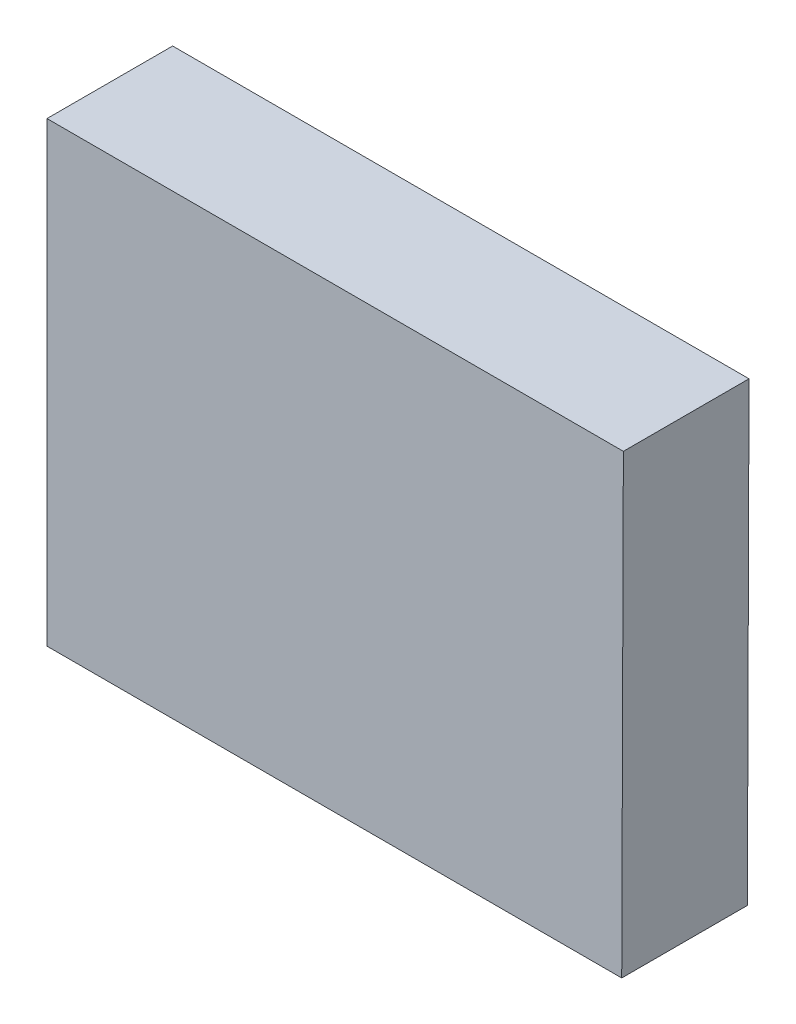
ISO-10303-21;
HEADER;
FILE_DESCRIPTION(('STEP AP214'),'2;1');
FILE_NAME('part.step','',(''),(''),'','','');
FILE_SCHEMA(('AUTOMOTIVE_DESIGN { 1 0 10303 214 1 1 1 1 }'));
ENDSEC;
DATA;
#1=APPLICATION_CONTEXT('core data for automotive mechanical design processes');
#2=APPLICATION_PROTOCOL_DEFINITION('international standard','automotive_design',2000,#1);
#3=PRODUCT_CONTEXT('',#1,'mechanical');
#4=PRODUCT('Part','Part','',(#3));
#5=PRODUCT_RELATED_PRODUCT_CATEGORY('part','',(#4));
#6=PRODUCT_DEFINITION_FORMATION('','',#4);
#7=PRODUCT_DEFINITION_CONTEXT('part definition',#1,'design');
#8=PRODUCT_DEFINITION('design','',#6,#7);
#9=PRODUCT_DEFINITION_SHAPE('','',#8);
#10=(LENGTH_UNIT() NAMED_UNIT(*) SI_UNIT(.MILLI.,.METRE.));
#11=(NAMED_UNIT(*) PLANE_ANGLE_UNIT() SI_UNIT($,.RADIAN.));
#12=(NAMED_UNIT(*) SI_UNIT($,.STERADIAN.) SOLID_ANGLE_UNIT());
#13=UNCERTAINTY_MEASURE_WITH_UNIT(LENGTH_MEASURE(1.E-05),#10,'distance_accuracy_value','');
#14=(GEOMETRIC_REPRESENTATION_CONTEXT(3) GLOBAL_UNCERTAINTY_ASSIGNED_CONTEXT((#13)) GLOBAL_UNIT_ASSIGNED_CONTEXT((#10,
#11,#12)) REPRESENTATION_CONTEXT('',''));
#15=CARTESIAN_POINT('',(0.,0.,0.));
#16=DIRECTION('',(0.,0.,1.));
#17=DIRECTION('',(1.,0.,0.));
#18=AXIS2_PLACEMENT_3D('',#15,#16,#17);
#19=CARTESIAN_POINT('',(2.50844558,-1.99999854,1.10000034));
#20=DIRECTION('',(0.,0.,1.));
#21=DIRECTION('',(1.,0.,0.));
#22=AXIS2_PLACEMENT_3D('',#19,#20,#21);
#23=PLANE('',#22);
#24=DIRECTION('',(0.,1.,0.));
#25=VECTOR('',#24,1.);
#26=CARTESIAN_POINT('',(-2.52276864,-1.99999346,1.10000034));
#27=LINE('',#26,#25);
#28=CARTESIAN_POINT('',(-2.52276864,-1.99999346000001,1.10000034));
#29=VERTEX_POINT('',#28);
#30=CARTESIAN_POINT('',(-2.52276864,2.00000108,1.10000034));
#31=VERTEX_POINT('',#30);
#32=EDGE_CURVE('E58',#29,#31,#27,.T.);
#33=ORIENTED_EDGE('',*,*,#32,.F.);
#34=DIRECTION('',(0.99999999999949,-1.0096966203115E-06,0.));
#35=VECTOR('',#34,1.);
#36=CARTESIAN_POINT('',(2.50844558,-1.99999854,1.10000034));
#37=LINE('',#36,#35);
#38=CARTESIAN_POINT('',(2.50844557999999,-1.99999854,1.10000034));
#39=VERTEX_POINT('',#38);
#40=EDGE_CURVE('E71',#39,#29,#37,.F.);
#41=ORIENTED_EDGE('',*,*,#40,.F.);
#42=DIRECTION('',(0.00358074238432357,0.999993589121439,0.));
#43=VECTOR('',#42,1.);
#44=CARTESIAN_POINT('',(2.52276864,2.00000108,1.10000034));
#45=LINE('',#44,#43);
#46=CARTESIAN_POINT('',(2.52276864,2.00000108,1.10000034));
#47=VERTEX_POINT('',#46);
#48=EDGE_CURVE('E20',#47,#39,#45,.F.);
#49=ORIENTED_EDGE('',*,*,#48,.F.);
#50=DIRECTION('',(1.,0.,0.));
#51=VECTOR('',#50,1.);
#52=CARTESIAN_POINT('',(-2.52276864,2.00000108,1.10000034));
#53=LINE('',#52,#51);
#54=EDGE_CURVE('E53',#31,#47,#53,.T.);
#55=ORIENTED_EDGE('',*,*,#54,.F.);
#56=EDGE_LOOP('',(#33,#41,#49,#55));
#57=FACE_BOUND('',#56,.T.);
#58=ADVANCED_FACE('F17',(#57),#23,.T.);
#59=CARTESIAN_POINT('',(2.52276864,2.00000108,0.));
#60=DIRECTION('',(0.999993589121439,-0.00358074238432357,0.));
#61=DIRECTION('',(0.00358074238432357,0.999993589121439,0.));
#62=AXIS2_PLACEMENT_3D('',#59,#60,#61);
#63=PLANE('',#62);
#64=DIRECTION('',(0.,0.,1.));
#65=VECTOR('',#64,1.);
#66=CARTESIAN_POINT('',(2.50844558,-1.99999854,0.));
#67=LINE('',#66,#65);
#68=CARTESIAN_POINT('',(2.50844557999999,-1.99999854,0.));
#69=VERTEX_POINT('',#68);
#70=EDGE_CURVE('E66',#69,#39,#67,.T.);
#71=ORIENTED_EDGE('',*,*,#70,.F.);
#72=DIRECTION('',(0.00358074238432357,0.999993589121439,0.));
#73=VECTOR('',#72,1.);
#74=CARTESIAN_POINT('',(2.52276864,2.00000108,0.));
#75=LINE('',#74,#73);
#76=CARTESIAN_POINT('',(2.52276864,2.00000108,0.));
#77=VERTEX_POINT('',#76);
#78=EDGE_CURVE('E74',#69,#77,#75,.T.);
#79=ORIENTED_EDGE('',*,*,#78,.T.);
#80=DIRECTION('',(0.,0.,1.));
#81=VECTOR('',#80,1.);
#82=CARTESIAN_POINT('',(2.52276864,2.00000108,0.));
#83=LINE('',#82,#81);
#84=EDGE_CURVE('E67',#47,#77,#83,.F.);
#85=ORIENTED_EDGE('',*,*,#84,.F.);
#86=ORIENTED_EDGE('',*,*,#48,.T.);
#87=EDGE_LOOP('',(#71,#79,#85,#86));
#88=FACE_BOUND('',#87,.T.);
#89=ADVANCED_FACE('F64',(#88),#63,.T.);
#90=CARTESIAN_POINT('',(-2.52276864,2.00000108,0.));
#91=DIRECTION('',(0.,1.,0.));
#92=DIRECTION('',(0.,0.,1.));
#93=AXIS2_PLACEMENT_3D('',#90,#91,#92);
#94=PLANE('',#93);
#95=ORIENTED_EDGE('',*,*,#84,.T.);
#96=DIRECTION('',(1.,0.,0.));
#97=VECTOR('',#96,1.);
#98=CARTESIAN_POINT('',(2.50844558,2.00000108,0.));
#99=LINE('',#98,#97);
#100=CARTESIAN_POINT('',(-2.52276864,2.00000108,0.));
#101=VERTEX_POINT('',#100);
#102=EDGE_CURVE('E77',#77,#101,#99,.F.);
#103=ORIENTED_EDGE('',*,*,#102,.T.);
#104=DIRECTION('',(0.,0.,1.));
#105=VECTOR('',#104,1.);
#106=CARTESIAN_POINT('',(-2.52276864,2.00000108,0.));
#107=LINE('',#106,#105);
#108=EDGE_CURVE('E72',#31,#101,#107,.F.);
#109=ORIENTED_EDGE('',*,*,#108,.F.);
#110=ORIENTED_EDGE('',*,*,#54,.T.);
#111=EDGE_LOOP('',(#95,#103,#109,#110));
#112=FACE_BOUND('',#111,.T.);
#113=ADVANCED_FACE('F101',(#112),#94,.T.);
#114=CARTESIAN_POINT('',(-2.52276864,-1.99999346,0.));
#115=DIRECTION('',(-1.,0.,0.));
#116=DIRECTION('',(0.,0.,1.));
#117=AXIS2_PLACEMENT_3D('',#114,#115,#116);
#118=PLANE('',#117);
#119=ORIENTED_EDGE('',*,*,#108,.T.);
#120=DIRECTION('',(0.,1.,0.));
#121=VECTOR('',#120,1.);
#122=CARTESIAN_POINT('',(-2.52276864,-1.99999854,0.));
#123=LINE('',#122,#121);
#124=CARTESIAN_POINT('',(-2.52276864,-1.99999346000001,0.));
#125=VERTEX_POINT('',#124);
#126=EDGE_CURVE('E26',#101,#125,#123,.F.);
#127=ORIENTED_EDGE('',*,*,#126,.T.);
#128=DIRECTION('',(0.,0.,1.));
#129=VECTOR('',#128,1.);
#130=CARTESIAN_POINT('',(-2.52276864,-1.99999346000001,0.));
#131=LINE('',#130,#129);
#132=EDGE_CURVE('E34',#29,#125,#131,.F.);
#133=ORIENTED_EDGE('',*,*,#132,.F.);
#134=ORIENTED_EDGE('',*,*,#32,.T.);
#135=EDGE_LOOP('',(#119,#127,#133,#134));
#136=FACE_BOUND('',#135,.T.);
#137=ADVANCED_FACE('F97',(#136),#118,.T.);
#138=CARTESIAN_POINT('',(2.50844558,-1.99999854,0.));
#139=DIRECTION('',(-1.0096966203115E-06,-0.99999999999949,0.));
#140=DIRECTION('',(0.99999999999949,-1.0096966203115E-06,0.));
#141=AXIS2_PLACEMENT_3D('',#138,#139,#140);
#142=PLANE('',#141);
#143=ORIENTED_EDGE('',*,*,#132,.T.);
#144=DIRECTION('',(0.99999999999949,-1.0096966203115E-06,0.));
#145=VECTOR('',#144,1.);
#146=CARTESIAN_POINT('',(2.50844558,-1.99999854,0.));
#147=LINE('',#146,#145);
#148=EDGE_CURVE('E11',#125,#69,#147,.T.);
#149=ORIENTED_EDGE('',*,*,#148,.T.);
#150=ORIENTED_EDGE('',*,*,#70,.T.);
#151=ORIENTED_EDGE('',*,*,#40,.T.);
#152=EDGE_LOOP('',(#143,#149,#150,#151));
#153=FACE_BOUND('',#152,.T.);
#154=ADVANCED_FACE('F70',(#153),#142,.T.);
#155=CARTESIAN_POINT('',(2.50844558,-1.99999854,0.));
#156=DIRECTION('',(0.,0.,1.));
#157=DIRECTION('',(1.,0.,0.));
#158=AXIS2_PLACEMENT_3D('',#155,#156,#157);
#159=PLANE('',#158);
#160=ORIENTED_EDGE('',*,*,#126,.F.);
#161=ORIENTED_EDGE('',*,*,#102,.F.);
#162=ORIENTED_EDGE('',*,*,#78,.F.);
#163=ORIENTED_EDGE('',*,*,#148,.F.);
#164=EDGE_LOOP('',(#160,#161,#162,#163));
#165=FACE_BOUND('',#164,.T.);
#166=ADVANCED_FACE('F100',(#165),#159,.F.);
#167=CLOSED_SHELL('',(#58,#89,#113,#137,#154,#166));
#168=MANIFOLD_SOLID_BREP('B1',#167);
#169=ADVANCED_BREP_SHAPE_REPRESENTATION('',(#18,#168),#14);
#170=SHAPE_DEFINITION_REPRESENTATION(#9,#169);
ENDSEC;
END-ISO-10303-21;
